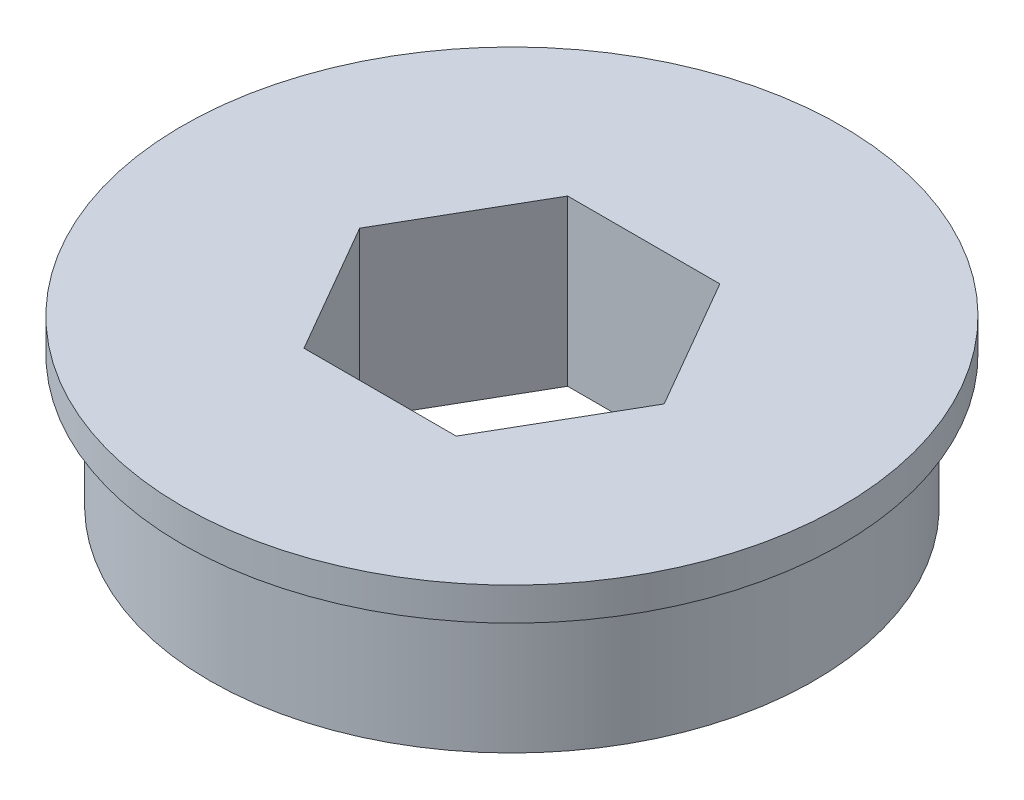
ISO-10303-21;
HEADER;
FILE_DESCRIPTION(('STEP AP214'),'2;1');
FILE_NAME('part.step','',(''),(''),'','','');
FILE_SCHEMA(('AUTOMOTIVE_DESIGN { 1 0 10303 214 1 1 1 1 }'));
ENDSEC;
DATA;
#1=APPLICATION_CONTEXT('core data for automotive mechanical design processes');
#2=APPLICATION_PROTOCOL_DEFINITION('international standard','automotive_design',2000,#1);
#3=PRODUCT_CONTEXT('',#1,'mechanical');
#4=PRODUCT('Part','Part','',(#3));
#5=PRODUCT_RELATED_PRODUCT_CATEGORY('part','',(#4));
#6=PRODUCT_DEFINITION_FORMATION('','',#4);
#7=PRODUCT_DEFINITION_CONTEXT('part definition',#1,'design');
#8=PRODUCT_DEFINITION('design','',#6,#7);
#9=PRODUCT_DEFINITION_SHAPE('','',#8);
#10=(LENGTH_UNIT() NAMED_UNIT(*) SI_UNIT(.MILLI.,.METRE.));
#11=(NAMED_UNIT(*) PLANE_ANGLE_UNIT() SI_UNIT($,.RADIAN.));
#12=(NAMED_UNIT(*) SI_UNIT($,.STERADIAN.) SOLID_ANGLE_UNIT());
#13=UNCERTAINTY_MEASURE_WITH_UNIT(LENGTH_MEASURE(1.E-05),#10,'distance_accuracy_value','');
#14=(GEOMETRIC_REPRESENTATION_CONTEXT(3) GLOBAL_UNCERTAINTY_ASSIGNED_CONTEXT((#13)) GLOBAL_UNIT_ASSIGNED_CONTEXT((#10,
#11,#12)) REPRESENTATION_CONTEXT('',''));
#15=CARTESIAN_POINT('',(0.,0.,0.));
#16=DIRECTION('',(0.,0.,1.));
#17=DIRECTION('',(1.,0.,0.));
#18=AXIS2_PLACEMENT_3D('',#15,#16,#17);
#19=CARTESIAN_POINT('',(0.,0.,0.));
#20=DIRECTION('',(0.,1.,0.));
#21=DIRECTION('',(0.,0.,1.));
#22=AXIS2_PLACEMENT_3D('',#19,#20,#21);
#23=PLANE('',#22);
#24=CARTESIAN_POINT('',(0.,0.,0.));
#25=DIRECTION('',(0.,1.,0.));
#26=DIRECTION('',(0.,0.,1.));
#27=AXIS2_PLACEMENT_3D('',#24,#25,#26);
#28=CIRCLE('',#27,14.5542);
#29=CARTESIAN_POINT('',(0.,0.,14.5542));
#30=VERTEX_POINT('',#29);
#31=EDGE_CURVE('E37',#30,#30,#28,.T.);
#32=ORIENTED_EDGE('',*,*,#31,.F.);
#33=EDGE_LOOP('',(#32));
#34=FACE_BOUND('',#33,.T.);
#35=DIRECTION('',(-0.5,0.,-0.866025403784438));
#36=VECTOR('',#35,1.);
#37=CARTESIAN_POINT('',(7.33234841870825,0.,0.));
#38=LINE('',#37,#36);
#39=CARTESIAN_POINT('',(7.33234841870825,0.,0.));
#40=VERTEX_POINT('',#39);
#41=CARTESIAN_POINT('',(3.66617420935412,0.,-6.35));
#42=VERTEX_POINT('',#41);
#43=EDGE_CURVE('E48',#40,#42,#38,.T.);
#44=ORIENTED_EDGE('',*,*,#43,.T.);
#45=DIRECTION('',(-1.,0.,0.));
#46=VECTOR('',#45,1.);
#47=CARTESIAN_POINT('',(3.66617420935412,0.,-6.35));
#48=LINE('',#47,#46);
#49=CARTESIAN_POINT('',(-3.66617420935412,0.,-6.35));
#50=VERTEX_POINT('',#49);
#51=EDGE_CURVE('E130',#42,#50,#48,.T.);
#52=ORIENTED_EDGE('',*,*,#51,.T.);
#53=DIRECTION('',(-0.5,0.,0.866025403784439));
#54=VECTOR('',#53,1.);
#55=CARTESIAN_POINT('',(-3.66617420935412,0.,-6.35));
#56=LINE('',#55,#54);
#57=CARTESIAN_POINT('',(-7.33234841870824,0.,0.));
#58=VERTEX_POINT('',#57);
#59=EDGE_CURVE('E133',#50,#58,#56,.T.);
#60=ORIENTED_EDGE('',*,*,#59,.T.);
#61=DIRECTION('',(0.5,0.,0.866025403784438));
#62=VECTOR('',#61,1.);
#63=CARTESIAN_POINT('',(-7.33234841870824,0.,0.));
#64=LINE('',#63,#62);
#65=CARTESIAN_POINT('',(-3.66617420935412,0.,6.35));
#66=VERTEX_POINT('',#65);
#67=EDGE_CURVE('E95',#58,#66,#64,.T.);
#68=ORIENTED_EDGE('',*,*,#67,.T.);
#69=DIRECTION('',(1.,0.,0.));
#70=VECTOR('',#69,1.);
#71=CARTESIAN_POINT('',(-3.66617420935412,0.,6.35));
#72=LINE('',#71,#70);
#73=CARTESIAN_POINT('',(3.66617420935412,0.,6.35));
#74=VERTEX_POINT('',#73);
#75=EDGE_CURVE('E136',#66,#74,#72,.T.);
#76=ORIENTED_EDGE('',*,*,#75,.T.);
#77=DIRECTION('',(0.5,0.,-0.866025403784439));
#78=VECTOR('',#77,1.);
#79=CARTESIAN_POINT('',(3.66617420935412,0.,6.35));
#80=LINE('',#79,#78);
#81=EDGE_CURVE('E139',#74,#40,#80,.T.);
#82=ORIENTED_EDGE('',*,*,#81,.T.);
#83=EDGE_LOOP('',(#44,#52,#60,#68,#76,#82));
#84=FACE_BOUND('',#83,.T.);
#85=ADVANCED_FACE('F33',(#34,#84),#23,.F.);
#86=CARTESIAN_POINT('',(0.,6.35,0.));
#87=DIRECTION('',(0.,-1.,0.));
#88=DIRECTION('',(0.,0.,-1.));
#89=AXIS2_PLACEMENT_3D('',#86,#87,#88);
#90=CYLINDRICAL_SURFACE('',#89,14.5542);
#91=CARTESIAN_POINT('',(0.,6.35,0.));
#92=DIRECTION('',(0.,1.,0.));
#93=DIRECTION('',(0.,0.,1.));
#94=AXIS2_PLACEMENT_3D('',#91,#92,#93);
#95=CIRCLE('',#94,14.5542);
#96=CARTESIAN_POINT('',(0.,6.35,14.5542));
#97=VERTEX_POINT('',#96);
#98=EDGE_CURVE('E11',#97,#97,#95,.T.);
#99=ORIENTED_EDGE('',*,*,#98,.F.);
#100=EDGE_LOOP('',(#99));
#101=FACE_BOUND('',#100,.T.);
#102=ORIENTED_EDGE('',*,*,#31,.T.);
#103=EDGE_LOOP('',(#102));
#104=FACE_BOUND('',#103,.T.);
#105=ADVANCED_FACE('F35',(#101,#104),#90,.T.);
#106=CARTESIAN_POINT('',(7.33234841870825,6.35,0.));
#107=DIRECTION('',(-0.866025403784438,0.,0.5));
#108=DIRECTION('',(0.5,0.,0.866025403784439));
#109=AXIS2_PLACEMENT_3D('',#106,#107,#108);
#110=PLANE('',#109);
#111=ORIENTED_EDGE('',*,*,#43,.F.);
#112=DIRECTION('',(0.,-1.,0.));
#113=VECTOR('',#112,1.);
#114=CARTESIAN_POINT('',(7.33234841870825,6.35,0.));
#115=LINE('',#114,#113);
#116=CARTESIAN_POINT('',(7.33234841870825,7.9375,0.));
#117=VERTEX_POINT('',#116);
#118=EDGE_CURVE('E142',#117,#40,#115,.T.);
#119=ORIENTED_EDGE('',*,*,#118,.F.);
#120=DIRECTION('',(-0.5,0.,-0.866025403784438));
#121=VECTOR('',#120,1.);
#122=CARTESIAN_POINT('',(7.33234841870825,7.9375,0.));
#123=LINE('',#122,#121);
#124=CARTESIAN_POINT('',(3.66617420935412,7.9375,-6.35));
#125=VERTEX_POINT('',#124);
#126=EDGE_CURVE('E118',#117,#125,#123,.T.);
#127=ORIENTED_EDGE('',*,*,#126,.T.);
#128=DIRECTION('',(0.,-1.,0.));
#129=VECTOR('',#128,1.);
#130=CARTESIAN_POINT('',(3.66617420935412,6.35,-6.35));
#131=LINE('',#130,#129);
#132=EDGE_CURVE('E147',#125,#42,#131,.T.);
#133=ORIENTED_EDGE('',*,*,#132,.T.);
#134=EDGE_LOOP('',(#111,#119,#127,#133));
#135=FACE_BOUND('',#134,.T.);
#136=ADVANCED_FACE('F157',(#135),#110,.T.);
#137=CARTESIAN_POINT('',(3.66617420935412,6.35,-6.35));
#138=DIRECTION('',(0.,0.,1.));
#139=DIRECTION('',(1.,0.,0.));
#140=AXIS2_PLACEMENT_3D('',#137,#138,#139);
#141=PLANE('',#140);
#142=ORIENTED_EDGE('',*,*,#51,.F.);
#143=ORIENTED_EDGE('',*,*,#132,.F.);
#144=DIRECTION('',(-1.,0.,0.));
#145=VECTOR('',#144,1.);
#146=CARTESIAN_POINT('',(3.66617420935412,7.9375,-6.35));
#147=LINE('',#146,#145);
#148=CARTESIAN_POINT('',(-3.66617420935412,7.9375,-6.35));
#149=VERTEX_POINT('',#148);
#150=EDGE_CURVE('E121',#125,#149,#147,.T.);
#151=ORIENTED_EDGE('',*,*,#150,.T.);
#152=DIRECTION('',(0.,-1.,0.));
#153=VECTOR('',#152,1.);
#154=CARTESIAN_POINT('',(-3.66617420935412,6.35,-6.35));
#155=LINE('',#154,#153);
#156=EDGE_CURVE('E99',#149,#50,#155,.T.);
#157=ORIENTED_EDGE('',*,*,#156,.T.);
#158=EDGE_LOOP('',(#142,#143,#151,#157));
#159=FACE_BOUND('',#158,.T.);
#160=ADVANCED_FACE('F159',(#159),#141,.T.);
#161=CARTESIAN_POINT('',(-3.66617420935412,6.35,-6.35));
#162=DIRECTION('',(0.866025403784439,0.,0.5));
#163=DIRECTION('',(0.5,0.,-0.866025403784439));
#164=AXIS2_PLACEMENT_3D('',#161,#162,#163);
#165=PLANE('',#164);
#166=ORIENTED_EDGE('',*,*,#59,.F.);
#167=ORIENTED_EDGE('',*,*,#156,.F.);
#168=DIRECTION('',(-0.5,0.,0.866025403784439));
#169=VECTOR('',#168,1.);
#170=CARTESIAN_POINT('',(-3.66617420935412,7.9375,-6.35));
#171=LINE('',#170,#169);
#172=CARTESIAN_POINT('',(-7.33234841870824,7.9375,0.));
#173=VERTEX_POINT('',#172);
#174=EDGE_CURVE('E103',#149,#173,#171,.T.);
#175=ORIENTED_EDGE('',*,*,#174,.T.);
#176=DIRECTION('',(0.,-1.,0.));
#177=VECTOR('',#176,1.);
#178=CARTESIAN_POINT('',(-7.33234841870824,6.35,0.));
#179=LINE('',#178,#177);
#180=EDGE_CURVE('E88',#173,#58,#179,.T.);
#181=ORIENTED_EDGE('',*,*,#180,.T.);
#182=EDGE_LOOP('',(#166,#167,#175,#181));
#183=FACE_BOUND('',#182,.T.);
#184=ADVANCED_FACE('F104',(#183),#165,.T.);
#185=CARTESIAN_POINT('',(-7.33234841870824,6.35,0.));
#186=DIRECTION('',(0.866025403784438,0.,-0.5));
#187=DIRECTION('',(-0.5,0.,-0.866025403784439));
#188=AXIS2_PLACEMENT_3D('',#185,#186,#187);
#189=PLANE('',#188);
#190=ORIENTED_EDGE('',*,*,#67,.F.);
#191=ORIENTED_EDGE('',*,*,#180,.F.);
#192=DIRECTION('',(0.5,0.,0.866025403784438));
#193=VECTOR('',#192,1.);
#194=CARTESIAN_POINT('',(-7.33234841870824,7.9375,0.));
#195=LINE('',#194,#193);
#196=CARTESIAN_POINT('',(-3.66617420935412,7.9375,6.35));
#197=VERTEX_POINT('',#196);
#198=EDGE_CURVE('E92',#173,#197,#195,.T.);
#199=ORIENTED_EDGE('',*,*,#198,.T.);
#200=DIRECTION('',(0.,-1.,0.));
#201=VECTOR('',#200,1.);
#202=CARTESIAN_POINT('',(-3.66617420935412,6.35,6.35));
#203=LINE('',#202,#201);
#204=EDGE_CURVE('E100',#197,#66,#203,.T.);
#205=ORIENTED_EDGE('',*,*,#204,.T.);
#206=EDGE_LOOP('',(#190,#191,#199,#205));
#207=FACE_BOUND('',#206,.T.);
#208=ADVANCED_FACE('F90',(#207),#189,.T.);
#209=CARTESIAN_POINT('',(-3.66617420935412,6.35,6.35));
#210=DIRECTION('',(0.,0.,-1.));
#211=DIRECTION('',(-1.,0.,0.));
#212=AXIS2_PLACEMENT_3D('',#209,#210,#211);
#213=PLANE('',#212);
#214=ORIENTED_EDGE('',*,*,#75,.F.);
#215=ORIENTED_EDGE('',*,*,#204,.F.);
#216=DIRECTION('',(1.,0.,0.));
#217=VECTOR('',#216,1.);
#218=CARTESIAN_POINT('',(-3.66617420935412,7.9375,6.35));
#219=LINE('',#218,#217);
#220=CARTESIAN_POINT('',(3.66617420935412,7.9375,6.35));
#221=VERTEX_POINT('',#220);
#222=EDGE_CURVE('E111',#197,#221,#219,.T.);
#223=ORIENTED_EDGE('',*,*,#222,.T.);
#224=DIRECTION('',(0.,-1.,0.));
#225=VECTOR('',#224,1.);
#226=CARTESIAN_POINT('',(3.66617420935412,6.35,6.35));
#227=LINE('',#226,#225);
#228=EDGE_CURVE('E56',#221,#74,#227,.T.);
#229=ORIENTED_EDGE('',*,*,#228,.T.);
#230=EDGE_LOOP('',(#214,#215,#223,#229));
#231=FACE_BOUND('',#230,.T.);
#232=ADVANCED_FACE('F171',(#231),#213,.T.);
#233=CARTESIAN_POINT('',(3.66617420935412,6.35,6.35));
#234=DIRECTION('',(-0.866025403784439,0.,-0.5));
#235=DIRECTION('',(-0.5,0.,0.866025403784439));
#236=AXIS2_PLACEMENT_3D('',#233,#234,#235);
#237=PLANE('',#236);
#238=ORIENTED_EDGE('',*,*,#81,.F.);
#239=ORIENTED_EDGE('',*,*,#228,.F.);
#240=DIRECTION('',(0.5,0.,-0.866025403784439));
#241=VECTOR('',#240,1.);
#242=CARTESIAN_POINT('',(3.66617420935412,7.9375,6.35));
#243=LINE('',#242,#241);
#244=EDGE_CURVE('E113',#221,#117,#243,.T.);
#245=ORIENTED_EDGE('',*,*,#244,.T.);
#246=ORIENTED_EDGE('',*,*,#118,.T.);
#247=EDGE_LOOP('',(#238,#239,#245,#246));
#248=FACE_BOUND('',#247,.T.);
#249=ADVANCED_FACE('F155',(#248),#237,.T.);
#250=CARTESIAN_POINT('',(0.,7.9375,0.));
#251=DIRECTION('',(0.,1.,0.));
#252=DIRECTION('',(0.,0.,1.));
#253=AXIS2_PLACEMENT_3D('',#250,#251,#252);
#254=PLANE('',#253);
#255=CARTESIAN_POINT('',(0.,7.9375,0.));
#256=DIRECTION('',(0.,1.,0.));
#257=DIRECTION('',(0.,0.,1.));
#258=AXIS2_PLACEMENT_3D('',#255,#256,#257);
#259=CIRCLE('',#258,15.875);
#260=CARTESIAN_POINT('',(0.,7.9375,15.875));
#261=VERTEX_POINT('',#260);
#262=EDGE_CURVE('E124',#261,#261,#259,.T.);
#263=ORIENTED_EDGE('',*,*,#262,.T.);
#264=EDGE_LOOP('',(#263));
#265=FACE_BOUND('',#264,.T.);
#266=ORIENTED_EDGE('',*,*,#198,.F.);
#267=ORIENTED_EDGE('',*,*,#174,.F.);
#268=ORIENTED_EDGE('',*,*,#150,.F.);
#269=ORIENTED_EDGE('',*,*,#126,.F.);
#270=ORIENTED_EDGE('',*,*,#244,.F.);
#271=ORIENTED_EDGE('',*,*,#222,.F.);
#272=EDGE_LOOP('',(#266,#267,#268,#269,#270,#271));
#273=FACE_BOUND('',#272,.T.);
#274=ADVANCED_FACE('F109',(#265,#273),#254,.T.);
#275=CARTESIAN_POINT('',(0.,6.35,0.));
#276=DIRECTION('',(0.,1.,0.));
#277=DIRECTION('',(0.,0.,1.));
#278=AXIS2_PLACEMENT_3D('',#275,#276,#277);
#279=PLANE('',#278);
#280=ORIENTED_EDGE('',*,*,#98,.T.);
#281=EDGE_LOOP('',(#280));
#282=FACE_BOUND('',#281,.T.);
#283=CARTESIAN_POINT('',(0.,6.35,0.));
#284=DIRECTION('',(0.,1.,0.));
#285=DIRECTION('',(0.,0.,1.));
#286=AXIS2_PLACEMENT_3D('',#283,#284,#285);
#287=CIRCLE('',#286,15.875);
#288=CARTESIAN_POINT('',(0.,6.35,15.875));
#289=VERTEX_POINT('',#288);
#290=EDGE_CURVE('E123',#289,#289,#287,.T.);
#291=ORIENTED_EDGE('',*,*,#290,.F.);
#292=EDGE_LOOP('',(#291));
#293=FACE_BOUND('',#292,.T.);
#294=ADVANCED_FACE('F179',(#282,#293),#279,.F.);
#295=CARTESIAN_POINT('',(0.,7.9375,0.));
#296=DIRECTION('',(0.,-1.,0.));
#297=DIRECTION('',(0.,0.,-1.));
#298=AXIS2_PLACEMENT_3D('',#295,#296,#297);
#299=CYLINDRICAL_SURFACE('',#298,15.875);
#300=ORIENTED_EDGE('',*,*,#262,.F.);
#301=EDGE_LOOP('',(#300));
#302=FACE_BOUND('',#301,.T.);
#303=ORIENTED_EDGE('',*,*,#290,.T.);
#304=EDGE_LOOP('',(#303));
#305=FACE_BOUND('',#304,.T.);
#306=ADVANCED_FACE('F176',(#302,#305),#299,.T.);
#307=CLOSED_SHELL('',(#85,#105,#136,#160,#184,#208,#232,#249,#274,#294,#306));
#308=MANIFOLD_SOLID_BREP('B2',#307);
#309=ADVANCED_BREP_SHAPE_REPRESENTATION('',(#18,#308),#14);
#310=SHAPE_DEFINITION_REPRESENTATION(#9,#309);
ENDSEC;
END-ISO-10303-21;
